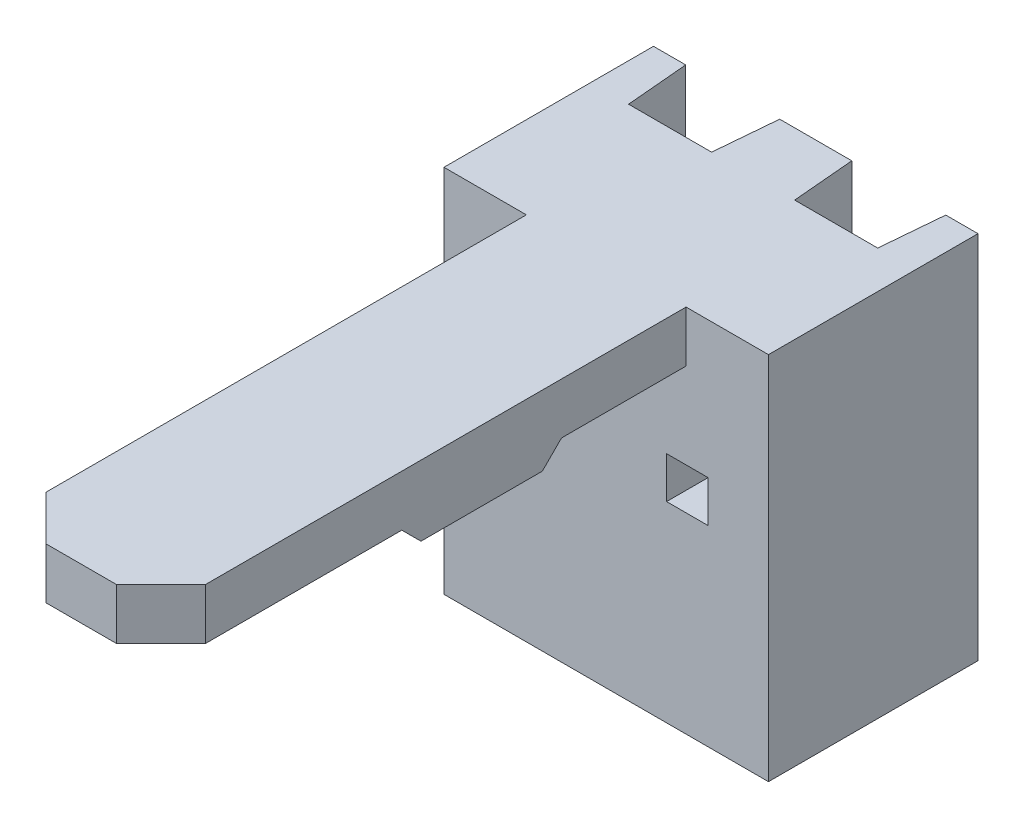
ISO-10303-21;
HEADER;
FILE_DESCRIPTION(('STEP AP214'),'2;1');
FILE_NAME('part.step','',(''),(''),'','','');
FILE_SCHEMA(('AUTOMOTIVE_DESIGN { 1 0 10303 214 1 1 1 1 }'));
ENDSEC;
DATA;
#1=APPLICATION_CONTEXT('core data for automotive mechanical design processes');
#2=APPLICATION_PROTOCOL_DEFINITION('international standard','automotive_design',2000,#1);
#3=PRODUCT_CONTEXT('',#1,'mechanical');
#4=PRODUCT('Part','Part','',(#3));
#5=PRODUCT_RELATED_PRODUCT_CATEGORY('part','',(#4));
#6=PRODUCT_DEFINITION_FORMATION('','',#4);
#7=PRODUCT_DEFINITION_CONTEXT('part definition',#1,'design');
#8=PRODUCT_DEFINITION('design','',#6,#7);
#9=PRODUCT_DEFINITION_SHAPE('','',#8);
#10=(LENGTH_UNIT() NAMED_UNIT(*) SI_UNIT(.MILLI.,.METRE.));
#11=(NAMED_UNIT(*) PLANE_ANGLE_UNIT() SI_UNIT($,.RADIAN.));
#12=(NAMED_UNIT(*) SI_UNIT($,.STERADIAN.) SOLID_ANGLE_UNIT());
#13=UNCERTAINTY_MEASURE_WITH_UNIT(LENGTH_MEASURE(1.E-05),#10,'distance_accuracy_value','');
#14=(GEOMETRIC_REPRESENTATION_CONTEXT(3) GLOBAL_UNCERTAINTY_ASSIGNED_CONTEXT((#13)) GLOBAL_UNIT_ASSIGNED_CONTEXT((#10,
#11,#12)) REPRESENTATION_CONTEXT('',''));
#15=CARTESIAN_POINT('',(0.,0.,0.));
#16=DIRECTION('',(0.,0.,1.));
#17=DIRECTION('',(1.,0.,0.));
#18=AXIS2_PLACEMENT_3D('',#15,#16,#17);
#19=CARTESIAN_POINT('',(0.,0.,-3.28));
#20=DIRECTION('',(0.,0.,1.));
#21=DIRECTION('',(1.,0.,0.));
#22=AXIS2_PLACEMENT_3D('',#19,#20,#21);
#23=PLANE('',#22);
#24=DIRECTION('',(1.,0.,0.));
#25=VECTOR('',#24,1.);
#26=CARTESIAN_POINT('',(0.,-2.895,-3.28));
#27=LINE('',#26,#25);
#28=CARTESIAN_POINT('',(-0.564261109744597,-2.895,-3.28));
#29=VERTEX_POINT('',#28);
#30=CARTESIAN_POINT('',(0.564261109744597,-2.895,-3.28));
#31=VERTEX_POINT('',#30);
#32=EDGE_CURVE('E225',#29,#31,#27,.T.);
#33=ORIENTED_EDGE('',*,*,#32,.F.);
#34=DIRECTION('',(0.,1.,0.));
#35=VECTOR('',#34,1.);
#36=CARTESIAN_POINT('',(-0.564261109744589,3.061095129369,-3.28));
#37=LINE('',#36,#35);
#38=CARTESIAN_POINT('',(-0.564261109744597,2.895,-3.28));
#39=VERTEX_POINT('',#38);
#40=EDGE_CURVE('E227',#29,#39,#37,.T.);
#41=ORIENTED_EDGE('',*,*,#40,.T.);
#42=DIRECTION('',(1.,0.,0.));
#43=VECTOR('',#42,1.);
#44=CARTESIAN_POINT('',(0.,2.895,-3.28));
#45=LINE('',#44,#43);
#46=CARTESIAN_POINT('',(0.564261109744597,2.895,-3.28));
#47=VERTEX_POINT('',#46);
#48=EDGE_CURVE('E20',#47,#39,#45,.F.);
#49=ORIENTED_EDGE('',*,*,#48,.F.);
#50=DIRECTION('',(0.,1.,0.));
#51=VECTOR('',#50,1.);
#52=CARTESIAN_POINT('',(0.564261109744589,3.061095129369,-3.28));
#53=LINE('',#52,#51);
#54=EDGE_CURVE('E246',#47,#31,#53,.F.);
#55=ORIENTED_EDGE('',*,*,#54,.T.);
#56=EDGE_LOOP('',(#33,#41,#49,#55));
#57=FACE_BOUND('',#56,.T.);
#58=ADVANCED_FACE('F17',(#57),#23,.F.);
#59=CARTESIAN_POINT('',(-0.65,3.061095129369,-2.3));
#60=DIRECTION('',(0.996194698091745,0.,0.087155742747664));
#61=DIRECTION('',(0.087155742747664,0.,-0.996194698091745));
#62=AXIS2_PLACEMENT_3D('',#59,#60,#61);
#63=PLANE('',#62);
#64=DIRECTION('',(0.087155742747664,0.,-0.996194698091745));
#65=VECTOR('',#64,1.);
#66=CARTESIAN_POINT('',(-0.65,-2.895,-2.3));
#67=LINE('',#66,#65);
#68=CARTESIAN_POINT('',(-0.65,-2.895,-2.3));
#69=VERTEX_POINT('',#68);
#70=EDGE_CURVE('E210',#69,#29,#67,.T.);
#71=ORIENTED_EDGE('',*,*,#70,.F.);
#72=DIRECTION('',(0.,1.,0.));
#73=VECTOR('',#72,1.);
#74=CARTESIAN_POINT('',(-0.65,-2.895,-2.3));
#75=LINE('',#74,#73);
#76=CARTESIAN_POINT('',(-0.65,2.895,-2.3));
#77=VERTEX_POINT('',#76);
#78=EDGE_CURVE('E233',#69,#77,#75,.T.);
#79=ORIENTED_EDGE('',*,*,#78,.T.);
#80=DIRECTION('',(0.087155742747664,0.,-0.996194698091745));
#81=VECTOR('',#80,1.);
#82=CARTESIAN_POINT('',(-0.65,2.895,-2.3));
#83=LINE('',#82,#81);
#84=EDGE_CURVE('E218',#39,#77,#83,.F.);
#85=ORIENTED_EDGE('',*,*,#84,.F.);
#86=ORIENTED_EDGE('',*,*,#40,.F.);
#87=EDGE_LOOP('',(#71,#79,#85,#86));
#88=FACE_BOUND('',#87,.T.);
#89=ADVANCED_FACE('F231',(#88),#63,.F.);
#90=CARTESIAN_POINT('',(-1.595,0.755,0.));
#91=DIRECTION('',(-1.,0.,0.));
#92=DIRECTION('',(0.,0.,1.));
#93=AXIS2_PLACEMENT_3D('',#90,#91,#92);
#94=PLANE('',#93);
#95=DIRECTION('',(0.,0.,-1.));
#96=VECTOR('',#95,1.);
#97=CARTESIAN_POINT('',(-1.595,0.105,0.));
#98=LINE('',#97,#96);
#99=CARTESIAN_POINT('',(-1.595,0.105,0.));
#100=VERTEX_POINT('',#99);
#101=CARTESIAN_POINT('',(-1.595,0.105,-2.3));
#102=VERTEX_POINT('',#101);
#103=EDGE_CURVE('E248',#100,#102,#98,.T.);
#104=ORIENTED_EDGE('',*,*,#103,.T.);
#105=DIRECTION('',(0.,1.,0.));
#106=VECTOR('',#105,1.);
#107=CARTESIAN_POINT('',(-1.595,-2.895,-2.3));
#108=LINE('',#107,#106);
#109=CARTESIAN_POINT('',(-1.595,0.755,-2.3));
#110=VERTEX_POINT('',#109);
#111=EDGE_CURVE('E258',#102,#110,#108,.T.);
#112=ORIENTED_EDGE('',*,*,#111,.T.);
#113=DIRECTION('',(0.,0.,1.));
#114=VECTOR('',#113,1.);
#115=CARTESIAN_POINT('',(-1.595,0.755,0.));
#116=LINE('',#115,#114);
#117=CARTESIAN_POINT('',(-1.595,0.755,0.));
#118=VERTEX_POINT('',#117);
#119=EDGE_CURVE('E266',#110,#118,#116,.T.);
#120=ORIENTED_EDGE('',*,*,#119,.T.);
#121=DIRECTION('',(0.,1.,0.));
#122=VECTOR('',#121,1.);
#123=CARTESIAN_POINT('',(-1.595,0.755,0.));
#124=LINE('',#123,#122);
#125=EDGE_CURVE('E229',#100,#118,#124,.T.);
#126=ORIENTED_EDGE('',*,*,#125,.F.);
#127=EDGE_LOOP('',(#104,#112,#120,#126));
#128=FACE_BOUND('',#127,.T.);
#129=ADVANCED_FACE('F490',(#128),#94,.F.);
#130=CARTESIAN_POINT('',(0.945,0.755,0.));
#131=DIRECTION('',(-1.,0.,0.));
#132=DIRECTION('',(0.,0.,1.));
#133=AXIS2_PLACEMENT_3D('',#130,#131,#132);
#134=PLANE('',#133);
#135=DIRECTION('',(0.,0.,-1.));
#136=VECTOR('',#135,1.);
#137=CARTESIAN_POINT('',(0.945,0.105,0.));
#138=LINE('',#137,#136);
#139=CARTESIAN_POINT('',(0.945,0.105,0.));
#140=VERTEX_POINT('',#139);
#141=CARTESIAN_POINT('',(0.945,0.105,-2.3));
#142=VERTEX_POINT('',#141);
#143=EDGE_CURVE('E271',#140,#142,#138,.T.);
#144=ORIENTED_EDGE('',*,*,#143,.T.);
#145=DIRECTION('',(0.,1.,0.));
#146=VECTOR('',#145,1.);
#147=CARTESIAN_POINT('',(0.945,0.755,-2.3));
#148=LINE('',#147,#146);
#149=CARTESIAN_POINT('',(0.945,0.755,-2.3));
#150=VERTEX_POINT('',#149);
#151=EDGE_CURVE('E239',#150,#142,#148,.F.);
#152=ORIENTED_EDGE('',*,*,#151,.F.);
#153=DIRECTION('',(0.,0.,1.));
#154=VECTOR('',#153,1.);
#155=CARTESIAN_POINT('',(0.945,0.755,0.));
#156=LINE('',#155,#154);
#157=CARTESIAN_POINT('',(0.945,0.755,0.));
#158=VERTEX_POINT('',#157);
#159=EDGE_CURVE('E277',#150,#158,#156,.T.);
#160=ORIENTED_EDGE('',*,*,#159,.T.);
#161=DIRECTION('',(0.,1.,0.));
#162=VECTOR('',#161,1.);
#163=CARTESIAN_POINT('',(0.945,0.755,0.));
#164=LINE('',#163,#162);
#165=EDGE_CURVE('E241',#140,#158,#164,.T.);
#166=ORIENTED_EDGE('',*,*,#165,.F.);
#167=EDGE_LOOP('',(#144,#152,#160,#166));
#168=FACE_BOUND('',#167,.T.);
#169=ADVANCED_FACE('F480',(#168),#134,.F.);
#170=CARTESIAN_POINT('',(0.65,3.061095129369,-2.3));
#171=DIRECTION('',(-0.996194698091745,0.,0.087155742747664));
#172=DIRECTION('',(0.087155742747664,0.,0.996194698091745));
#173=AXIS2_PLACEMENT_3D('',#170,#171,#172);
#174=PLANE('',#173);
#175=DIRECTION('',(0.087155742747664,0.,0.996194698091745));
#176=VECTOR('',#175,1.);
#177=CARTESIAN_POINT('',(0.65,2.895,-2.3));
#178=LINE('',#177,#176);
#179=CARTESIAN_POINT('',(0.65,2.895,-2.3));
#180=VERTEX_POINT('',#179);
#181=EDGE_CURVE('E221',#180,#47,#178,.F.);
#182=ORIENTED_EDGE('',*,*,#181,.F.);
#183=DIRECTION('',(0.,1.,0.));
#184=VECTOR('',#183,1.);
#185=CARTESIAN_POINT('',(0.65,-2.895,-2.3));
#186=LINE('',#185,#184);
#187=CARTESIAN_POINT('',(0.65,-2.895,-2.3));
#188=VERTEX_POINT('',#187);
#189=EDGE_CURVE('E284',#180,#188,#186,.F.);
#190=ORIENTED_EDGE('',*,*,#189,.T.);
#191=DIRECTION('',(0.087155742747664,0.,0.996194698091745));
#192=VECTOR('',#191,1.);
#193=CARTESIAN_POINT('',(0.65,-2.895,-2.3));
#194=LINE('',#193,#192);
#195=EDGE_CURVE('E243',#31,#188,#194,.T.);
#196=ORIENTED_EDGE('',*,*,#195,.F.);
#197=ORIENTED_EDGE('',*,*,#54,.F.);
#198=EDGE_LOOP('',(#182,#190,#196,#197));
#199=FACE_BOUND('',#198,.T.);
#200=ADVANCED_FACE('F477',(#199),#174,.F.);
#201=CARTESIAN_POINT('',(-1.595,0.105,0.));
#202=DIRECTION('',(0.,-1.,0.));
#203=DIRECTION('',(0.,0.,-1.));
#204=AXIS2_PLACEMENT_3D('',#201,#202,#203);
#205=PLANE('',#204);
#206=DIRECTION('',(0.,0.,-1.));
#207=VECTOR('',#206,1.);
#208=CARTESIAN_POINT('',(-0.945,0.105,0.));
#209=LINE('',#208,#207);
#210=CARTESIAN_POINT('',(-0.945,0.105,0.));
#211=VERTEX_POINT('',#210);
#212=CARTESIAN_POINT('',(-0.945,0.105,-2.3));
#213=VERTEX_POINT('',#212);
#214=EDGE_CURVE('E309',#211,#213,#209,.T.);
#215=ORIENTED_EDGE('',*,*,#214,.T.);
#216=DIRECTION('',(1.,0.,0.));
#217=VECTOR('',#216,1.);
#218=CARTESIAN_POINT('',(-0.65,0.105,-2.3));
#219=LINE('',#218,#217);
#220=EDGE_CURVE('E260',#213,#102,#219,.F.);
#221=ORIENTED_EDGE('',*,*,#220,.T.);
#222=ORIENTED_EDGE('',*,*,#103,.F.);
#223=DIRECTION('',(1.,0.,0.));
#224=VECTOR('',#223,1.);
#225=CARTESIAN_POINT('',(-1.595,0.105,0.));
#226=LINE('',#225,#224);
#227=EDGE_CURVE('E250',#211,#100,#226,.F.);
#228=ORIENTED_EDGE('',*,*,#227,.F.);
#229=EDGE_LOOP('',(#215,#221,#222,#228));
#230=FACE_BOUND('',#229,.T.);
#231=ADVANCED_FACE('F479',(#230),#205,.F.);
#232=CARTESIAN_POINT('',(-0.65,-2.895,-2.3));
#233=DIRECTION('',(0.,0.,1.));
#234=DIRECTION('',(1.,0.,0.));
#235=AXIS2_PLACEMENT_3D('',#232,#233,#234);
#236=PLANE('',#235);
#237=DIRECTION('',(0.,1.,0.));
#238=VECTOR('',#237,1.);
#239=CARTESIAN_POINT('',(-0.945,0.105,-2.3));
#240=LINE('',#239,#238);
#241=CARTESIAN_POINT('',(-0.945,0.755,-2.3));
#242=VERTEX_POINT('',#241);
#243=EDGE_CURVE('E311',#213,#242,#240,.T.);
#244=ORIENTED_EDGE('',*,*,#243,.T.);
#245=DIRECTION('',(1.,0.,0.));
#246=VECTOR('',#245,1.);
#247=CARTESIAN_POINT('',(-0.945,0.755,-2.3));
#248=LINE('',#247,#246);
#249=EDGE_CURVE('E263',#242,#110,#248,.F.);
#250=ORIENTED_EDGE('',*,*,#249,.T.);
#251=ORIENTED_EDGE('',*,*,#111,.F.);
#252=ORIENTED_EDGE('',*,*,#220,.F.);
#253=EDGE_LOOP('',(#244,#250,#251,#252));
#254=FACE_BOUND('',#253,.T.);
#255=DIRECTION('',(0.,1.,0.));
#256=VECTOR('',#255,1.);
#257=CARTESIAN_POINT('',(-1.95,3.061095129369,-2.3));
#258=LINE('',#257,#256);
#259=CARTESIAN_POINT('',(-1.95,-2.895,-2.3));
#260=VERTEX_POINT('',#259);
#261=CARTESIAN_POINT('',(-1.95,2.895,-2.3));
#262=VERTEX_POINT('',#261);
#263=EDGE_CURVE('E296',#260,#262,#258,.T.);
#264=ORIENTED_EDGE('',*,*,#263,.T.);
#265=DIRECTION('',(1.,0.,0.));
#266=VECTOR('',#265,1.);
#267=CARTESIAN_POINT('',(-0.65,2.895,-2.3));
#268=LINE('',#267,#266);
#269=EDGE_CURVE('E254',#77,#262,#268,.F.);
#270=ORIENTED_EDGE('',*,*,#269,.F.);
#271=ORIENTED_EDGE('',*,*,#78,.F.);
#272=DIRECTION('',(1.,0.,0.));
#273=VECTOR('',#272,1.);
#274=CARTESIAN_POINT('',(-0.65,-2.895,-2.3));
#275=LINE('',#274,#273);
#276=EDGE_CURVE('E256',#260,#69,#275,.T.);
#277=ORIENTED_EDGE('',*,*,#276,.F.);
#278=EDGE_LOOP('',(#264,#270,#271,#277));
#279=FACE_BOUND('',#278,.T.);
#280=ADVANCED_FACE('F487',(#254,#279),#236,.F.);
#281=CARTESIAN_POINT('',(-0.945,0.755,0.));
#282=DIRECTION('',(0.,1.,0.));
#283=DIRECTION('',(0.,0.,1.));
#284=AXIS2_PLACEMENT_3D('',#281,#282,#283);
#285=PLANE('',#284);
#286=ORIENTED_EDGE('',*,*,#119,.F.);
#287=ORIENTED_EDGE('',*,*,#249,.F.);
#288=DIRECTION('',(0.,0.,-1.));
#289=VECTOR('',#288,1.);
#290=CARTESIAN_POINT('',(-0.945,0.755,0.));
#291=LINE('',#290,#289);
#292=CARTESIAN_POINT('',(-0.945,0.755,0.));
#293=VERTEX_POINT('',#292);
#294=EDGE_CURVE('E313',#242,#293,#291,.F.);
#295=ORIENTED_EDGE('',*,*,#294,.T.);
#296=DIRECTION('',(1.,0.,0.));
#297=VECTOR('',#296,1.);
#298=CARTESIAN_POINT('',(-0.945,0.755,0.));
#299=LINE('',#298,#297);
#300=EDGE_CURVE('E269',#118,#293,#299,.T.);
#301=ORIENTED_EDGE('',*,*,#300,.F.);
#302=EDGE_LOOP('',(#286,#287,#295,#301));
#303=FACE_BOUND('',#302,.T.);
#304=ADVANCED_FACE('F577',(#303),#285,.F.);
#305=CARTESIAN_POINT('',(0.945,0.105,0.));
#306=DIRECTION('',(0.,-1.,0.));
#307=DIRECTION('',(0.,0.,-1.));
#308=AXIS2_PLACEMENT_3D('',#305,#306,#307);
#309=PLANE('',#308);
#310=DIRECTION('',(0.,0.,-1.));
#311=VECTOR('',#310,1.);
#312=CARTESIAN_POINT('',(1.595,0.105,0.));
#313=LINE('',#312,#311);
#314=CARTESIAN_POINT('',(1.595,0.105,0.));
#315=VERTEX_POINT('',#314);
#316=CARTESIAN_POINT('',(1.595,0.105,-2.3));
#317=VERTEX_POINT('',#316);
#318=EDGE_CURVE('E316',#315,#317,#313,.T.);
#319=ORIENTED_EDGE('',*,*,#318,.T.);
#320=DIRECTION('',(1.,0.,0.));
#321=VECTOR('',#320,1.);
#322=CARTESIAN_POINT('',(1.95,0.105,-2.3));
#323=LINE('',#322,#321);
#324=EDGE_CURVE('E291',#317,#142,#323,.F.);
#325=ORIENTED_EDGE('',*,*,#324,.T.);
#326=ORIENTED_EDGE('',*,*,#143,.F.);
#327=DIRECTION('',(1.,0.,0.));
#328=VECTOR('',#327,1.);
#329=CARTESIAN_POINT('',(0.945,0.105,0.));
#330=LINE('',#329,#328);
#331=EDGE_CURVE('E274',#315,#140,#330,.F.);
#332=ORIENTED_EDGE('',*,*,#331,.F.);
#333=EDGE_LOOP('',(#319,#325,#326,#332));
#334=FACE_BOUND('',#333,.T.);
#335=ADVANCED_FACE('F573',(#334),#309,.F.);
#336=CARTESIAN_POINT('',(1.595,0.755,0.));
#337=DIRECTION('',(0.,1.,0.));
#338=DIRECTION('',(0.,0.,1.));
#339=AXIS2_PLACEMENT_3D('',#336,#337,#338);
#340=PLANE('',#339);
#341=ORIENTED_EDGE('',*,*,#159,.F.);
#342=DIRECTION('',(1.,0.,0.));
#343=VECTOR('',#342,1.);
#344=CARTESIAN_POINT('',(1.95,0.755,-2.3));
#345=LINE('',#344,#343);
#346=CARTESIAN_POINT('',(1.595,0.755,-2.3));
#347=VERTEX_POINT('',#346);
#348=EDGE_CURVE('E289',#150,#347,#345,.T.);
#349=ORIENTED_EDGE('',*,*,#348,.T.);
#350=DIRECTION('',(0.,0.,-1.));
#351=VECTOR('',#350,1.);
#352=CARTESIAN_POINT('',(1.595,0.755,0.));
#353=LINE('',#352,#351);
#354=CARTESIAN_POINT('',(1.595,0.755,0.));
#355=VERTEX_POINT('',#354);
#356=EDGE_CURVE('E321',#347,#355,#353,.F.);
#357=ORIENTED_EDGE('',*,*,#356,.T.);
#358=DIRECTION('',(1.,0.,0.));
#359=VECTOR('',#358,1.);
#360=CARTESIAN_POINT('',(1.595,0.755,0.));
#361=LINE('',#360,#359);
#362=EDGE_CURVE('E280',#158,#355,#361,.T.);
#363=ORIENTED_EDGE('',*,*,#362,.F.);
#364=EDGE_LOOP('',(#341,#349,#357,#363));
#365=FACE_BOUND('',#364,.T.);
#366=ADVANCED_FACE('F569',(#365),#340,.F.);
#367=CARTESIAN_POINT('',(1.95,-2.895,-2.3));
#368=DIRECTION('',(0.,0.,1.));
#369=DIRECTION('',(1.,0.,0.));
#370=AXIS2_PLACEMENT_3D('',#367,#368,#369);
#371=PLANE('',#370);
#372=DIRECTION('',(0.,1.,0.));
#373=VECTOR('',#372,1.);
#374=CARTESIAN_POINT('',(1.595,0.105,-2.3));
#375=LINE('',#374,#373);
#376=EDGE_CURVE('E318',#317,#347,#375,.T.);
#377=ORIENTED_EDGE('',*,*,#376,.T.);
#378=ORIENTED_EDGE('',*,*,#348,.F.);
#379=ORIENTED_EDGE('',*,*,#151,.T.);
#380=ORIENTED_EDGE('',*,*,#324,.F.);
#381=EDGE_LOOP('',(#377,#378,#379,#380));
#382=FACE_BOUND('',#381,.T.);
#383=ORIENTED_EDGE('',*,*,#189,.F.);
#384=DIRECTION('',(1.,0.,0.));
#385=VECTOR('',#384,1.);
#386=CARTESIAN_POINT('',(1.95,2.895,-2.3));
#387=LINE('',#386,#385);
#388=CARTESIAN_POINT('',(1.95,2.895,-2.3));
#389=VERTEX_POINT('',#388);
#390=EDGE_CURVE('E282',#389,#180,#387,.F.);
#391=ORIENTED_EDGE('',*,*,#390,.F.);
#392=DIRECTION('',(0.,1.,0.));
#393=VECTOR('',#392,1.);
#394=CARTESIAN_POINT('',(1.95,3.061095129369,-2.3));
#395=LINE('',#394,#393);
#396=CARTESIAN_POINT('',(1.95,-2.895,-2.3));
#397=VERTEX_POINT('',#396);
#398=EDGE_CURVE('E326',#389,#397,#395,.F.);
#399=ORIENTED_EDGE('',*,*,#398,.T.);
#400=DIRECTION('',(1.,0.,0.));
#401=VECTOR('',#400,1.);
#402=CARTESIAN_POINT('',(1.95,-2.895,-2.3));
#403=LINE('',#402,#401);
#404=EDGE_CURVE('E287',#188,#397,#403,.T.);
#405=ORIENTED_EDGE('',*,*,#404,.F.);
#406=EDGE_LOOP('',(#383,#391,#399,#405));
#407=FACE_BOUND('',#406,.T.);
#408=ADVANCED_FACE('F475',(#382,#407),#371,.F.);
#409=CARTESIAN_POINT('',(-1.95,3.061095129369,-2.3));
#410=DIRECTION('',(-0.996194698091745,0.,0.087155742747664));
#411=DIRECTION('',(0.087155742747664,0.,0.996194698091745));
#412=AXIS2_PLACEMENT_3D('',#409,#410,#411);
#413=PLANE('',#412);
#414=DIRECTION('',(0.087155742747664,0.,0.996194698091745));
#415=VECTOR('',#414,1.);
#416=CARTESIAN_POINT('',(-1.95,2.895,-2.3));
#417=LINE('',#416,#415);
#418=CARTESIAN_POINT('',(-2.0357388902551,2.895,-3.27999999999999));
#419=VERTEX_POINT('',#418);
#420=EDGE_CURVE('E299',#262,#419,#417,.F.);
#421=ORIENTED_EDGE('',*,*,#420,.F.);
#422=ORIENTED_EDGE('',*,*,#263,.F.);
#423=DIRECTION('',(0.087155742747664,0.,0.996194698091745));
#424=VECTOR('',#423,1.);
#425=CARTESIAN_POINT('',(-1.95,-2.895,-2.3));
#426=LINE('',#425,#424);
#427=CARTESIAN_POINT('',(-2.0357388902552,-2.895,-3.27999999999998));
#428=VERTEX_POINT('',#427);
#429=EDGE_CURVE('E294',#428,#260,#426,.T.);
#430=ORIENTED_EDGE('',*,*,#429,.F.);
#431=DIRECTION('',(0.,1.,0.));
#432=VECTOR('',#431,1.);
#433=CARTESIAN_POINT('',(-2.035738890255,0.,-3.28));
#434=LINE('',#433,#432);
#435=EDGE_CURVE('E331',#428,#419,#434,.T.);
#436=ORIENTED_EDGE('',*,*,#435,.T.);
#437=EDGE_LOOP('',(#421,#422,#430,#436));
#438=FACE_BOUND('',#437,.T.);
#439=ADVANCED_FACE('F562',(#438),#413,.F.);
#440=CARTESIAN_POINT('',(0.,1.945,2.1));
#441=DIRECTION('',(0.,-0.707106781186548,-0.707106781186548));
#442=DIRECTION('',(0.,0.707106781186548,-0.707106781186548));
#443=AXIS2_PLACEMENT_3D('',#440,#441,#442);
#444=PLANE('',#443);
#445=DIRECTION('',(0.,0.707106781186548,-0.707106781186548));
#446=VECTOR('',#445,1.);
#447=CARTESIAN_POINT('',(-1.25,1.945,2.1));
#448=LINE('',#447,#446);
#449=CARTESIAN_POINT('',(-1.25,1.795,2.25));
#450=VERTEX_POINT('',#449);
#451=CARTESIAN_POINT('',(-1.25,2.095,1.95));
#452=VERTEX_POINT('',#451);
#453=EDGE_CURVE('E303',#450,#452,#448,.T.);
#454=ORIENTED_EDGE('',*,*,#453,.T.);
#455=DIRECTION('',(1.,0.,0.));
#456=VECTOR('',#455,1.);
#457=CARTESIAN_POINT('',(-1.25,2.095,1.95));
#458=LINE('',#457,#456);
#459=CARTESIAN_POINT('',(1.25,2.095,1.95));
#460=VERTEX_POINT('',#459);
#461=EDGE_CURVE('E340',#460,#452,#458,.F.);
#462=ORIENTED_EDGE('',*,*,#461,.F.);
#463=DIRECTION('',(0.,0.707106781186548,-0.707106781186548));
#464=VECTOR('',#463,1.);
#465=CARTESIAN_POINT('',(1.25,1.945,2.1));
#466=LINE('',#465,#464);
#467=CARTESIAN_POINT('',(1.25,1.795,2.25));
#468=VERTEX_POINT('',#467);
#469=EDGE_CURVE('E301',#460,#468,#466,.F.);
#470=ORIENTED_EDGE('',*,*,#469,.T.);
#471=DIRECTION('',(1.,0.,0.));
#472=VECTOR('',#471,1.);
#473=CARTESIAN_POINT('',(0.,1.795,2.25));
#474=LINE('',#473,#472);
#475=EDGE_CURVE('E337',#450,#468,#474,.T.);
#476=ORIENTED_EDGE('',*,*,#475,.F.);
#477=EDGE_LOOP('',(#454,#462,#470,#476));
#478=FACE_BOUND('',#477,.T.);
#479=ADVANCED_FACE('F558',(#478),#444,.T.);
#480=CARTESIAN_POINT('',(0.,1.945,4.3));
#481=DIRECTION('',(0.,-0.707106781186548,0.707106781186548));
#482=DIRECTION('',(0.,-0.707106781186548,-0.707106781186548));
#483=AXIS2_PLACEMENT_3D('',#480,#481,#482);
#484=PLANE('',#483);
#485=DIRECTION('',(0.,-0.707106781186548,-0.707106781186548));
#486=VECTOR('',#485,1.);
#487=CARTESIAN_POINT('',(1.25,1.945,4.3));
#488=LINE('',#487,#486);
#489=CARTESIAN_POINT('',(1.25,1.795,4.15));
#490=VERTEX_POINT('',#489);
#491=CARTESIAN_POINT('',(1.25,2.095,4.45));
#492=VERTEX_POINT('',#491);
#493=EDGE_CURVE('E307',#490,#492,#488,.F.);
#494=ORIENTED_EDGE('',*,*,#493,.T.);
#495=DIRECTION('',(1.,0.,0.));
#496=VECTOR('',#495,1.);
#497=CARTESIAN_POINT('',(-1.25,2.095,4.45));
#498=LINE('',#497,#496);
#499=CARTESIAN_POINT('',(-1.25,2.095,4.45));
#500=VERTEX_POINT('',#499);
#501=EDGE_CURVE('E343',#500,#492,#498,.T.);
#502=ORIENTED_EDGE('',*,*,#501,.F.);
#503=DIRECTION('',(0.,-0.707106781186548,-0.707106781186548));
#504=VECTOR('',#503,1.);
#505=CARTESIAN_POINT('',(-1.25,1.945,4.3));
#506=LINE('',#505,#504);
#507=CARTESIAN_POINT('',(-1.25,1.795,4.15));
#508=VERTEX_POINT('',#507);
#509=EDGE_CURVE('E305',#500,#508,#506,.T.);
#510=ORIENTED_EDGE('',*,*,#509,.T.);
#511=DIRECTION('',(1.,0.,0.));
#512=VECTOR('',#511,1.);
#513=CARTESIAN_POINT('',(0.,1.795,4.15));
#514=LINE('',#513,#512);
#515=EDGE_CURVE('E334',#490,#508,#514,.F.);
#516=ORIENTED_EDGE('',*,*,#515,.F.);
#517=EDGE_LOOP('',(#494,#502,#510,#516));
#518=FACE_BOUND('',#517,.T.);
#519=ADVANCED_FACE('F554',(#518),#484,.T.);
#520=CARTESIAN_POINT('',(-0.945,0.105,0.));
#521=DIRECTION('',(1.,0.,0.));
#522=DIRECTION('',(0.,0.,-1.));
#523=AXIS2_PLACEMENT_3D('',#520,#521,#522);
#524=PLANE('',#523);
#525=ORIENTED_EDGE('',*,*,#294,.F.);
#526=ORIENTED_EDGE('',*,*,#243,.F.);
#527=ORIENTED_EDGE('',*,*,#214,.F.);
#528=DIRECTION('',(0.,1.,0.));
#529=VECTOR('',#528,1.);
#530=CARTESIAN_POINT('',(-0.945,0.,0.));
#531=LINE('',#530,#529);
#532=EDGE_CURVE('E352',#293,#211,#531,.F.);
#533=ORIENTED_EDGE('',*,*,#532,.F.);
#534=EDGE_LOOP('',(#525,#526,#527,#533));
#535=FACE_BOUND('',#534,.T.);
#536=ADVANCED_FACE('F550',(#535),#524,.F.);
#537=CARTESIAN_POINT('',(1.595,0.105,0.));
#538=DIRECTION('',(1.,0.,0.));
#539=DIRECTION('',(0.,0.,-1.));
#540=AXIS2_PLACEMENT_3D('',#537,#538,#539);
#541=PLANE('',#540);
#542=ORIENTED_EDGE('',*,*,#356,.F.);
#543=ORIENTED_EDGE('',*,*,#376,.F.);
#544=ORIENTED_EDGE('',*,*,#318,.F.);
#545=DIRECTION('',(0.,1.,0.));
#546=VECTOR('',#545,1.);
#547=CARTESIAN_POINT('',(1.595,0.,0.));
#548=LINE('',#547,#546);
#549=EDGE_CURVE('E355',#355,#315,#548,.F.);
#550=ORIENTED_EDGE('',*,*,#549,.F.);
#551=EDGE_LOOP('',(#542,#543,#544,#550));
#552=FACE_BOUND('',#551,.T.);
#553=ADVANCED_FACE('F547',(#552),#541,.F.);
#554=CARTESIAN_POINT('',(1.95,3.061095129369,-2.3));
#555=DIRECTION('',(0.996194698091745,0.,0.087155742747664));
#556=DIRECTION('',(0.087155742747664,0.,-0.996194698091745));
#557=AXIS2_PLACEMENT_3D('',#554,#555,#556);
#558=PLANE('',#557);
#559=DIRECTION('',(0.08715574274725,0.,-0.996194698091781));
#560=VECTOR('',#559,1.);
#561=CARTESIAN_POINT('',(1.95,-2.895,-2.3));
#562=LINE('',#561,#560);
#563=CARTESIAN_POINT('',(2.0357388902551,-2.895,-3.27999999999999));
#564=VERTEX_POINT('',#563);
#565=EDGE_CURVE('E358',#397,#564,#562,.T.);
#566=ORIENTED_EDGE('',*,*,#565,.F.);
#567=ORIENTED_EDGE('',*,*,#398,.F.);
#568=DIRECTION('',(0.087155742747664,0.,-0.996194698091745));
#569=VECTOR('',#568,1.);
#570=CARTESIAN_POINT('',(1.95,2.895,-2.3));
#571=LINE('',#570,#569);
#572=CARTESIAN_POINT('',(2.0357388902551,2.895,-3.27999999999999));
#573=VERTEX_POINT('',#572);
#574=EDGE_CURVE('E324',#573,#389,#571,.F.);
#575=ORIENTED_EDGE('',*,*,#574,.F.);
#576=DIRECTION('',(0.,1.,0.));
#577=VECTOR('',#576,1.);
#578=CARTESIAN_POINT('',(2.035738890255,0.,-3.28));
#579=LINE('',#578,#577);
#580=EDGE_CURVE('E369',#573,#564,#579,.F.);
#581=ORIENTED_EDGE('',*,*,#580,.T.);
#582=EDGE_LOOP('',(#566,#567,#575,#581));
#583=FACE_BOUND('',#582,.T.);
#584=ADVANCED_FACE('F467',(#583),#558,.F.);
#585=CARTESIAN_POINT('',(0.,0.,-3.28));
#586=DIRECTION('',(0.,0.,1.));
#587=DIRECTION('',(1.,0.,0.));
#588=AXIS2_PLACEMENT_3D('',#585,#586,#587);
#589=PLANE('',#588);
#590=DIRECTION('',(1.,0.,0.));
#591=VECTOR('',#590,1.);
#592=CARTESIAN_POINT('',(-2.54,-2.895,-3.28));
#593=LINE('',#592,#591);
#594=CARTESIAN_POINT('',(-2.54,-2.895,-3.28));
#595=VERTEX_POINT('',#594);
#596=EDGE_CURVE('E363',#595,#428,#593,.T.);
#597=ORIENTED_EDGE('',*,*,#596,.F.);
#598=DIRECTION('',(0.,1.,0.));
#599=VECTOR('',#598,1.);
#600=CARTESIAN_POINT('',(-2.54,2.895,-3.28));
#601=LINE('',#600,#599);
#602=CARTESIAN_POINT('',(-2.54,2.895,-3.28));
#603=VERTEX_POINT('',#602);
#604=EDGE_CURVE('E375',#603,#595,#601,.F.);
#605=ORIENTED_EDGE('',*,*,#604,.F.);
#606=DIRECTION('',(1.,0.,0.));
#607=VECTOR('',#606,1.);
#608=CARTESIAN_POINT('',(0.,2.895,-3.28));
#609=LINE('',#608,#607);
#610=EDGE_CURVE('E329',#419,#603,#609,.F.);
#611=ORIENTED_EDGE('',*,*,#610,.F.);
#612=ORIENTED_EDGE('',*,*,#435,.F.);
#613=EDGE_LOOP('',(#597,#605,#611,#612));
#614=FACE_BOUND('',#613,.T.);
#615=ADVANCED_FACE('F540',(#614),#589,.F.);
#616=CARTESIAN_POINT('',(0.,1.795,8.22));
#617=DIRECTION('',(0.,-1.,0.));
#618=DIRECTION('',(0.,0.,-1.));
#619=AXIS2_PLACEMENT_3D('',#616,#617,#618);
#620=PLANE('',#619);
#621=ORIENTED_EDGE('',*,*,#475,.T.);
#622=DIRECTION('',(0.,0.,-1.));
#623=VECTOR('',#622,1.);
#624=CARTESIAN_POINT('',(1.25,1.795,0.));
#625=LINE('',#624,#623);
#626=EDGE_CURVE('E408',#490,#468,#625,.T.);
#627=ORIENTED_EDGE('',*,*,#626,.F.);
#628=ORIENTED_EDGE('',*,*,#515,.T.);
#629=DIRECTION('',(0.,0.,1.));
#630=VECTOR('',#629,1.);
#631=CARTESIAN_POINT('',(-1.25,1.795,0.));
#632=LINE('',#631,#630);
#633=EDGE_CURVE('E390',#450,#508,#632,.T.);
#634=ORIENTED_EDGE('',*,*,#633,.F.);
#635=EDGE_LOOP('',(#621,#627,#628,#634));
#636=FACE_BOUND('',#635,.T.);
#637=ADVANCED_FACE('F536',(#636),#620,.T.);
#638=CARTESIAN_POINT('',(-1.25,2.095,0.));
#639=DIRECTION('',(0.,-1.,0.));
#640=DIRECTION('',(0.,0.,-1.));
#641=AXIS2_PLACEMENT_3D('',#638,#639,#640);
#642=PLANE('',#641);
#643=DIRECTION('',(1.,0.,0.));
#644=VECTOR('',#643,1.);
#645=CARTESIAN_POINT('',(0.,2.095,0.));
#646=LINE('',#645,#644);
#647=CARTESIAN_POINT('',(1.25,2.095,0.));
#648=VERTEX_POINT('',#647);
#649=CARTESIAN_POINT('',(-1.25,2.095,0.));
#650=VERTEX_POINT('',#649);
#651=EDGE_CURVE('E350',#648,#650,#646,.F.);
#652=ORIENTED_EDGE('',*,*,#651,.F.);
#653=DIRECTION('',(0.,0.,-1.));
#654=VECTOR('',#653,1.);
#655=CARTESIAN_POINT('',(1.25,2.095,0.));
#656=LINE('',#655,#654);
#657=EDGE_CURVE('E411',#460,#648,#656,.T.);
#658=ORIENTED_EDGE('',*,*,#657,.F.);
#659=ORIENTED_EDGE('',*,*,#461,.T.);
#660=DIRECTION('',(0.,0.,1.));
#661=VECTOR('',#660,1.);
#662=CARTESIAN_POINT('',(-1.25,2.095,0.));
#663=LINE('',#662,#661);
#664=EDGE_CURVE('E387',#650,#452,#663,.T.);
#665=ORIENTED_EDGE('',*,*,#664,.F.);
#666=EDGE_LOOP('',(#652,#658,#659,#665));
#667=FACE_BOUND('',#666,.T.);
#668=ADVANCED_FACE('F532',(#667),#642,.T.);
#669=CARTESIAN_POINT('',(-1.25,2.095,0.));
#670=DIRECTION('',(0.,-1.,0.));
#671=DIRECTION('',(0.,0.,-1.));
#672=AXIS2_PLACEMENT_3D('',#669,#670,#671);
#673=PLANE('',#672);
#674=DIRECTION('',(0.707106781186548,0.,0.707106781186548));
#675=VECTOR('',#674,1.);
#676=CARTESIAN_POINT('',(-0.9,2.095,7.87));
#677=LINE('',#676,#675);
#678=CARTESIAN_POINT('',(-1.25,2.095,7.52));
#679=VERTEX_POINT('',#678);
#680=CARTESIAN_POINT('',(-0.549999999999999,2.095,8.22));
#681=VERTEX_POINT('',#680);
#682=EDGE_CURVE('E393',#679,#681,#677,.T.);
#683=ORIENTED_EDGE('',*,*,#682,.F.);
#684=DIRECTION('',(0.,0.,1.));
#685=VECTOR('',#684,1.);
#686=CARTESIAN_POINT('',(-1.25,2.095,0.));
#687=LINE('',#686,#685);
#688=EDGE_CURVE('E381',#500,#679,#687,.T.);
#689=ORIENTED_EDGE('',*,*,#688,.F.);
#690=ORIENTED_EDGE('',*,*,#501,.T.);
#691=DIRECTION('',(0.,0.,-1.));
#692=VECTOR('',#691,1.);
#693=CARTESIAN_POINT('',(1.25,2.095,0.));
#694=LINE('',#693,#692);
#695=CARTESIAN_POINT('',(1.25,2.095,7.52));
#696=VERTEX_POINT('',#695);
#697=EDGE_CURVE('E420',#696,#492,#694,.T.);
#698=ORIENTED_EDGE('',*,*,#697,.F.);
#699=DIRECTION('',(0.707106781186548,0.,-0.707106781186548));
#700=VECTOR('',#699,1.);
#701=CARTESIAN_POINT('',(0.9,2.095,7.87));
#702=LINE('',#701,#700);
#703=CARTESIAN_POINT('',(0.55,2.095,8.22));
#704=VERTEX_POINT('',#703);
#705=EDGE_CURVE('E406',#704,#696,#702,.T.);
#706=ORIENTED_EDGE('',*,*,#705,.F.);
#707=DIRECTION('',(1.,0.,0.));
#708=VECTOR('',#707,1.);
#709=CARTESIAN_POINT('',(0.,2.095,8.22));
#710=LINE('',#709,#708);
#711=EDGE_CURVE('E401',#681,#704,#710,.T.);
#712=ORIENTED_EDGE('',*,*,#711,.F.);
#713=EDGE_LOOP('',(#683,#689,#690,#698,#706,#712));
#714=FACE_BOUND('',#713,.T.);
#715=ADVANCED_FACE('F528',(#714),#673,.T.);
#716=CARTESIAN_POINT('',(0.,0.,0.));
#717=DIRECTION('',(0.,0.,1.));
#718=DIRECTION('',(1.,0.,0.));
#719=AXIS2_PLACEMENT_3D('',#716,#717,#718);
#720=PLANE('',#719);
#721=ORIENTED_EDGE('',*,*,#362,.T.);
#722=ORIENTED_EDGE('',*,*,#549,.T.);
#723=ORIENTED_EDGE('',*,*,#331,.T.);
#724=ORIENTED_EDGE('',*,*,#165,.T.);
#725=EDGE_LOOP('',(#721,#722,#723,#724));
#726=FACE_BOUND('',#725,.T.);
#727=ORIENTED_EDGE('',*,*,#300,.T.);
#728=ORIENTED_EDGE('',*,*,#532,.T.);
#729=ORIENTED_EDGE('',*,*,#227,.T.);
#730=ORIENTED_EDGE('',*,*,#125,.T.);
#731=EDGE_LOOP('',(#727,#728,#729,#730));
#732=FACE_BOUND('',#731,.T.);
#733=DIRECTION('',(0.,1.,0.));
#734=VECTOR('',#733,1.);
#735=CARTESIAN_POINT('',(1.25,2.095,0.));
#736=LINE('',#735,#734);
#737=CARTESIAN_POINT('',(1.25,2.895,0.));
#738=VERTEX_POINT('',#737);
#739=EDGE_CURVE('E414',#648,#738,#736,.T.);
#740=ORIENTED_EDGE('',*,*,#739,.F.);
#741=ORIENTED_EDGE('',*,*,#651,.T.);
#742=DIRECTION('',(0.,1.,0.));
#743=VECTOR('',#742,1.);
#744=CARTESIAN_POINT('',(-1.25,2.895,0.));
#745=LINE('',#744,#743);
#746=CARTESIAN_POINT('',(-1.25,2.895,0.));
#747=VERTEX_POINT('',#746);
#748=EDGE_CURVE('E384',#747,#650,#745,.F.);
#749=ORIENTED_EDGE('',*,*,#748,.F.);
#750=DIRECTION('',(1.,0.,0.));
#751=VECTOR('',#750,1.);
#752=CARTESIAN_POINT('',(0.,2.895,0.));
#753=LINE('',#752,#751);
#754=CARTESIAN_POINT('',(-2.54,2.895,0.));
#755=VERTEX_POINT('',#754);
#756=EDGE_CURVE('E346',#747,#755,#753,.F.);
#757=ORIENTED_EDGE('',*,*,#756,.T.);
#758=DIRECTION('',(0.,1.,0.));
#759=VECTOR('',#758,1.);
#760=CARTESIAN_POINT('',(-2.54,2.895,0.));
#761=LINE('',#760,#759);
#762=CARTESIAN_POINT('',(-2.54,-2.895,0.));
#763=VERTEX_POINT('',#762);
#764=EDGE_CURVE('E372',#763,#755,#761,.T.);
#765=ORIENTED_EDGE('',*,*,#764,.F.);
#766=DIRECTION('',(1.,0.,0.));
#767=VECTOR('',#766,1.);
#768=CARTESIAN_POINT('',(-2.54,-2.895,0.));
#769=LINE('',#768,#767);
#770=CARTESIAN_POINT('',(2.54,-2.895,0.));
#771=VERTEX_POINT('',#770);
#772=EDGE_CURVE('E360',#771,#763,#769,.F.);
#773=ORIENTED_EDGE('',*,*,#772,.F.);
#774=DIRECTION('',(0.,1.,0.));
#775=VECTOR('',#774,1.);
#776=CARTESIAN_POINT('',(2.54,-2.895,0.));
#777=LINE('',#776,#775);
#778=CARTESIAN_POINT('',(2.54,2.895,0.));
#779=VERTEX_POINT('',#778);
#780=EDGE_CURVE('E423',#779,#771,#777,.F.);
#781=ORIENTED_EDGE('',*,*,#780,.F.);
#782=DIRECTION('',(1.,0.,0.));
#783=VECTOR('',#782,1.);
#784=CARTESIAN_POINT('',(0.,2.895,0.));
#785=LINE('',#784,#783);
#786=EDGE_CURVE('E348',#779,#738,#785,.F.);
#787=ORIENTED_EDGE('',*,*,#786,.T.);
#788=EDGE_LOOP('',(#740,#741,#749,#757,#765,#773,#781,#787));
#789=FACE_BOUND('',#788,.T.);
#790=ADVANCED_FACE('F455',(#726,#732,#789),#720,.T.);
#791=CARTESIAN_POINT('',(-2.54,-2.895,0.));
#792=DIRECTION('',(0.,-1.,0.));
#793=DIRECTION('',(0.,0.,-1.));
#794=AXIS2_PLACEMENT_3D('',#791,#792,#793);
#795=PLANE('',#794);
#796=ORIENTED_EDGE('',*,*,#195,.T.);
#797=ORIENTED_EDGE('',*,*,#404,.T.);
#798=ORIENTED_EDGE('',*,*,#565,.T.);
#799=DIRECTION('',(1.,0.,0.));
#800=VECTOR('',#799,1.);
#801=CARTESIAN_POINT('',(0.,-2.895,-3.28));
#802=LINE('',#801,#800);
#803=CARTESIAN_POINT('',(2.54,-2.895,-3.28));
#804=VERTEX_POINT('',#803);
#805=EDGE_CURVE('E366',#564,#804,#802,.T.);
#806=ORIENTED_EDGE('',*,*,#805,.T.);
#807=DIRECTION('',(0.,0.,-1.));
#808=VECTOR('',#807,1.);
#809=CARTESIAN_POINT('',(2.54,-2.895,0.));
#810=LINE('',#809,#808);
#811=EDGE_CURVE('E426',#771,#804,#810,.T.);
#812=ORIENTED_EDGE('',*,*,#811,.F.);
#813=ORIENTED_EDGE('',*,*,#772,.T.);
#814=DIRECTION('',(0.,0.,1.));
#815=VECTOR('',#814,1.);
#816=CARTESIAN_POINT('',(-2.54,-2.895,0.));
#817=LINE('',#816,#815);
#818=EDGE_CURVE('E378',#595,#763,#817,.T.);
#819=ORIENTED_EDGE('',*,*,#818,.F.);
#820=ORIENTED_EDGE('',*,*,#596,.T.);
#821=ORIENTED_EDGE('',*,*,#429,.T.);
#822=ORIENTED_EDGE('',*,*,#276,.T.);
#823=ORIENTED_EDGE('',*,*,#70,.T.);
#824=ORIENTED_EDGE('',*,*,#32,.T.);
#825=EDGE_LOOP('',(#796,#797,#798,#806,#812,#813,#819,#820,#821,#822,#823,#824));
#826=FACE_BOUND('',#825,.T.);
#827=ADVANCED_FACE('F470',(#826),#795,.T.);
#828=CARTESIAN_POINT('',(0.,0.,-3.28));
#829=DIRECTION('',(0.,0.,1.));
#830=DIRECTION('',(1.,0.,0.));
#831=AXIS2_PLACEMENT_3D('',#828,#829,#830);
#832=PLANE('',#831);
#833=DIRECTION('',(1.,0.,0.));
#834=VECTOR('',#833,1.);
#835=CARTESIAN_POINT('',(0.,2.895,-3.28));
#836=LINE('',#835,#834);
#837=CARTESIAN_POINT('',(2.54,2.895,-3.28));
#838=VERTEX_POINT('',#837);
#839=EDGE_CURVE('E35',#838,#573,#836,.F.);
#840=ORIENTED_EDGE('',*,*,#839,.F.);
#841=DIRECTION('',(0.,1.,0.));
#842=VECTOR('',#841,1.);
#843=CARTESIAN_POINT('',(2.54,-2.895,-3.28));
#844=LINE('',#843,#842);
#845=EDGE_CURVE('E429',#804,#838,#844,.T.);
#846=ORIENTED_EDGE('',*,*,#845,.F.);
#847=ORIENTED_EDGE('',*,*,#805,.F.);
#848=ORIENTED_EDGE('',*,*,#580,.F.);
#849=EDGE_LOOP('',(#840,#846,#847,#848));
#850=FACE_BOUND('',#849,.T.);
#851=ADVANCED_FACE('F469',(#850),#832,.F.);
#852=CARTESIAN_POINT('',(-2.54,2.895,0.));
#853=DIRECTION('',(-1.,0.,0.));
#854=DIRECTION('',(0.,0.,1.));
#855=AXIS2_PLACEMENT_3D('',#852,#853,#854);
#856=PLANE('',#855);
#857=ORIENTED_EDGE('',*,*,#604,.T.);
#858=ORIENTED_EDGE('',*,*,#818,.T.);
#859=ORIENTED_EDGE('',*,*,#764,.T.);
#860=DIRECTION('',(0.,0.,1.));
#861=VECTOR('',#860,1.);
#862=CARTESIAN_POINT('',(-2.54,2.895,0.));
#863=LINE('',#862,#861);
#864=EDGE_CURVE('E431',#603,#755,#863,.T.);
#865=ORIENTED_EDGE('',*,*,#864,.F.);
#866=EDGE_LOOP('',(#857,#858,#859,#865));
#867=FACE_BOUND('',#866,.T.);
#868=ADVANCED_FACE('F517',(#867),#856,.T.);
#869=CARTESIAN_POINT('',(-1.25,2.895,0.));
#870=DIRECTION('',(-1.,0.,0.));
#871=DIRECTION('',(0.,0.,1.));
#872=AXIS2_PLACEMENT_3D('',#869,#870,#871);
#873=PLANE('',#872);
#874=ORIENTED_EDGE('',*,*,#453,.F.);
#875=ORIENTED_EDGE('',*,*,#633,.T.);
#876=ORIENTED_EDGE('',*,*,#509,.F.);
#877=ORIENTED_EDGE('',*,*,#688,.T.);
#878=DIRECTION('',(0.,1.,0.));
#879=VECTOR('',#878,1.);
#880=CARTESIAN_POINT('',(-1.25,2.495,7.52));
#881=LINE('',#880,#879);
#882=CARTESIAN_POINT('',(-1.25,2.895,7.52));
#883=VERTEX_POINT('',#882);
#884=EDGE_CURVE('E395',#883,#679,#881,.F.);
#885=ORIENTED_EDGE('',*,*,#884,.F.);
#886=DIRECTION('',(0.,0.,1.));
#887=VECTOR('',#886,1.);
#888=CARTESIAN_POINT('',(-1.25,2.895,0.));
#889=LINE('',#888,#887);
#890=EDGE_CURVE('E434',#747,#883,#889,.T.);
#891=ORIENTED_EDGE('',*,*,#890,.F.);
#892=ORIENTED_EDGE('',*,*,#748,.T.);
#893=ORIENTED_EDGE('',*,*,#664,.T.);
#894=EDGE_LOOP('',(#874,#875,#876,#877,#885,#891,#892,#893));
#895=FACE_BOUND('',#894,.T.);
#896=ADVANCED_FACE('F513',(#895),#873,.T.);
#897=CARTESIAN_POINT('',(-0.9,2.495,7.87));
#898=DIRECTION('',(-0.707106781186548,0.,0.707106781186548));
#899=DIRECTION('',(0.707106781186548,0.,0.707106781186548));
#900=AXIS2_PLACEMENT_3D('',#897,#898,#899);
#901=PLANE('',#900);
#902=DIRECTION('',(0.707106781186546,0.,0.707106781186549));
#903=VECTOR('',#902,1.);
#904=CARTESIAN_POINT('',(-1.25,2.895,7.52));
#905=LINE('',#904,#903);
#906=CARTESIAN_POINT('',(-0.549999999999999,2.895,8.22));
#907=VERTEX_POINT('',#906);
#908=EDGE_CURVE('E437',#883,#907,#905,.T.);
#909=ORIENTED_EDGE('',*,*,#908,.F.);
#910=ORIENTED_EDGE('',*,*,#884,.T.);
#911=ORIENTED_EDGE('',*,*,#682,.T.);
#912=DIRECTION('',(0.,1.,0.));
#913=VECTOR('',#912,1.);
#914=CARTESIAN_POINT('',(-0.55,0.,8.22));
#915=LINE('',#914,#913);
#916=EDGE_CURVE('E398',#907,#681,#915,.F.);
#917=ORIENTED_EDGE('',*,*,#916,.F.);
#918=EDGE_LOOP('',(#909,#910,#911,#917));
#919=FACE_BOUND('',#918,.T.);
#920=ADVANCED_FACE('F509',(#919),#901,.T.);
#921=CARTESIAN_POINT('',(0.,0.,8.22));
#922=DIRECTION('',(0.,0.,1.));
#923=DIRECTION('',(1.,0.,0.));
#924=AXIS2_PLACEMENT_3D('',#921,#922,#923);
#925=PLANE('',#924);
#926=ORIENTED_EDGE('',*,*,#916,.T.);
#927=ORIENTED_EDGE('',*,*,#711,.T.);
#928=DIRECTION('',(0.,1.,0.));
#929=VECTOR('',#928,1.);
#930=CARTESIAN_POINT('',(0.549999999999999,2.495,8.22));
#931=LINE('',#930,#929);
#932=CARTESIAN_POINT('',(0.55,2.895,8.22));
#933=VERTEX_POINT('',#932);
#934=EDGE_CURVE('E403',#933,#704,#931,.F.);
#935=ORIENTED_EDGE('',*,*,#934,.F.);
#936=DIRECTION('',(1.,0.,0.));
#937=VECTOR('',#936,1.);
#938=CARTESIAN_POINT('',(2.54,2.895,8.22));
#939=LINE('',#938,#937);
#940=EDGE_CURVE('E440',#907,#933,#939,.T.);
#941=ORIENTED_EDGE('',*,*,#940,.F.);
#942=EDGE_LOOP('',(#926,#927,#935,#941));
#943=FACE_BOUND('',#942,.T.);
#944=ADVANCED_FACE('F505',(#943),#925,.T.);
#945=CARTESIAN_POINT('',(0.9,2.495,7.87));
#946=DIRECTION('',(0.707106781186548,0.,0.707106781186548));
#947=DIRECTION('',(0.707106781186548,0.,-0.707106781186548));
#948=AXIS2_PLACEMENT_3D('',#945,#946,#947);
#949=PLANE('',#948);
#950=ORIENTED_EDGE('',*,*,#705,.T.);
#951=DIRECTION('',(0.,1.,0.));
#952=VECTOR('',#951,1.);
#953=CARTESIAN_POINT('',(1.25,2.095,7.52));
#954=LINE('',#953,#952);
#955=CARTESIAN_POINT('',(1.25,2.895,7.52));
#956=VERTEX_POINT('',#955);
#957=EDGE_CURVE('E417',#956,#696,#954,.F.);
#958=ORIENTED_EDGE('',*,*,#957,.F.);
#959=DIRECTION('',(0.707106781186546,0.,-0.707106781186548));
#960=VECTOR('',#959,1.);
#961=CARTESIAN_POINT('',(0.55,2.895,8.22));
#962=LINE('',#961,#960);
#963=EDGE_CURVE('E443',#933,#956,#962,.T.);
#964=ORIENTED_EDGE('',*,*,#963,.F.);
#965=ORIENTED_EDGE('',*,*,#934,.T.);
#966=EDGE_LOOP('',(#950,#958,#964,#965));
#967=FACE_BOUND('',#966,.T.);
#968=ADVANCED_FACE('F502',(#967),#949,.T.);
#969=CARTESIAN_POINT('',(1.25,2.095,0.));
#970=DIRECTION('',(1.,0.,0.));
#971=DIRECTION('',(0.,0.,-1.));
#972=AXIS2_PLACEMENT_3D('',#969,#970,#971);
#973=PLANE('',#972);
#974=ORIENTED_EDGE('',*,*,#957,.T.);
#975=ORIENTED_EDGE('',*,*,#697,.T.);
#976=ORIENTED_EDGE('',*,*,#493,.F.);
#977=ORIENTED_EDGE('',*,*,#626,.T.);
#978=ORIENTED_EDGE('',*,*,#469,.F.);
#979=ORIENTED_EDGE('',*,*,#657,.T.);
#980=ORIENTED_EDGE('',*,*,#739,.T.);
#981=DIRECTION('',(0.,0.,1.));
#982=VECTOR('',#981,1.);
#983=CARTESIAN_POINT('',(1.25,2.895,0.));
#984=LINE('',#983,#982);
#985=EDGE_CURVE('E26',#956,#738,#984,.F.);
#986=ORIENTED_EDGE('',*,*,#985,.F.);
#987=EDGE_LOOP('',(#974,#975,#976,#977,#978,#979,#980,#986));
#988=FACE_BOUND('',#987,.T.);
#989=ADVANCED_FACE('F451',(#988),#973,.T.);
#990=CARTESIAN_POINT('',(2.54,-2.895,0.));
#991=DIRECTION('',(1.,0.,0.));
#992=DIRECTION('',(0.,0.,-1.));
#993=AXIS2_PLACEMENT_3D('',#990,#991,#992);
#994=PLANE('',#993);
#995=ORIENTED_EDGE('',*,*,#845,.T.);
#996=DIRECTION('',(0.,0.,1.));
#997=VECTOR('',#996,1.);
#998=CARTESIAN_POINT('',(2.54,2.895,0.));
#999=LINE('',#998,#997);
#1000=EDGE_CURVE('E11',#779,#838,#999,.F.);
#1001=ORIENTED_EDGE('',*,*,#1000,.F.);
#1002=ORIENTED_EDGE('',*,*,#780,.T.);
#1003=ORIENTED_EDGE('',*,*,#811,.T.);
#1004=EDGE_LOOP('',(#995,#1001,#1002,#1003));
#1005=FACE_BOUND('',#1004,.T.);
#1006=ADVANCED_FACE('F461',(#1005),#994,.T.);
#1007=CARTESIAN_POINT('',(2.54,2.895,0.));
#1008=DIRECTION('',(0.,1.,0.));
#1009=DIRECTION('',(0.,0.,1.));
#1010=AXIS2_PLACEMENT_3D('',#1007,#1008,#1009);
#1011=PLANE('',#1010);
#1012=ORIENTED_EDGE('',*,*,#1000,.T.);
#1013=ORIENTED_EDGE('',*,*,#839,.T.);
#1014=ORIENTED_EDGE('',*,*,#574,.T.);
#1015=ORIENTED_EDGE('',*,*,#390,.T.);
#1016=ORIENTED_EDGE('',*,*,#181,.T.);
#1017=ORIENTED_EDGE('',*,*,#48,.T.);
#1018=ORIENTED_EDGE('',*,*,#84,.T.);
#1019=ORIENTED_EDGE('',*,*,#269,.T.);
#1020=ORIENTED_EDGE('',*,*,#420,.T.);
#1021=ORIENTED_EDGE('',*,*,#610,.T.);
#1022=ORIENTED_EDGE('',*,*,#864,.T.);
#1023=ORIENTED_EDGE('',*,*,#756,.F.);
#1024=ORIENTED_EDGE('',*,*,#890,.T.);
#1025=ORIENTED_EDGE('',*,*,#908,.T.);
#1026=ORIENTED_EDGE('',*,*,#940,.T.);
#1027=ORIENTED_EDGE('',*,*,#963,.T.);
#1028=ORIENTED_EDGE('',*,*,#985,.T.);
#1029=ORIENTED_EDGE('',*,*,#786,.F.);
#1030=EDGE_LOOP('',(#1012,#1013,#1014,#1015,#1016,#1017,#1018,#1019,#1020,#1021,#1022,#1023,
#1024,#1025,#1026,#1027,#1028,#1029));
#1031=FACE_BOUND('',#1030,.T.);
#1032=ADVANCED_FACE('F216',(#1031),#1011,.T.);
#1033=CLOSED_SHELL('',(#58,#89,#129,#169,#200,#231,#280,#304,#335,#366,#408,#439,#479,#519,#536,
#553,#584,#615,#637,#668,#715,#790,#827,#851,#868,#896,#920,#944,#968,#989,#1006,#1032));
#1034=MANIFOLD_SOLID_BREP('B1',#1033);
#1035=ADVANCED_BREP_SHAPE_REPRESENTATION('',(#18,#1034),#14);
#1036=SHAPE_DEFINITION_REPRESENTATION(#9,#1035);
ENDSEC;
END-ISO-10303-21;
